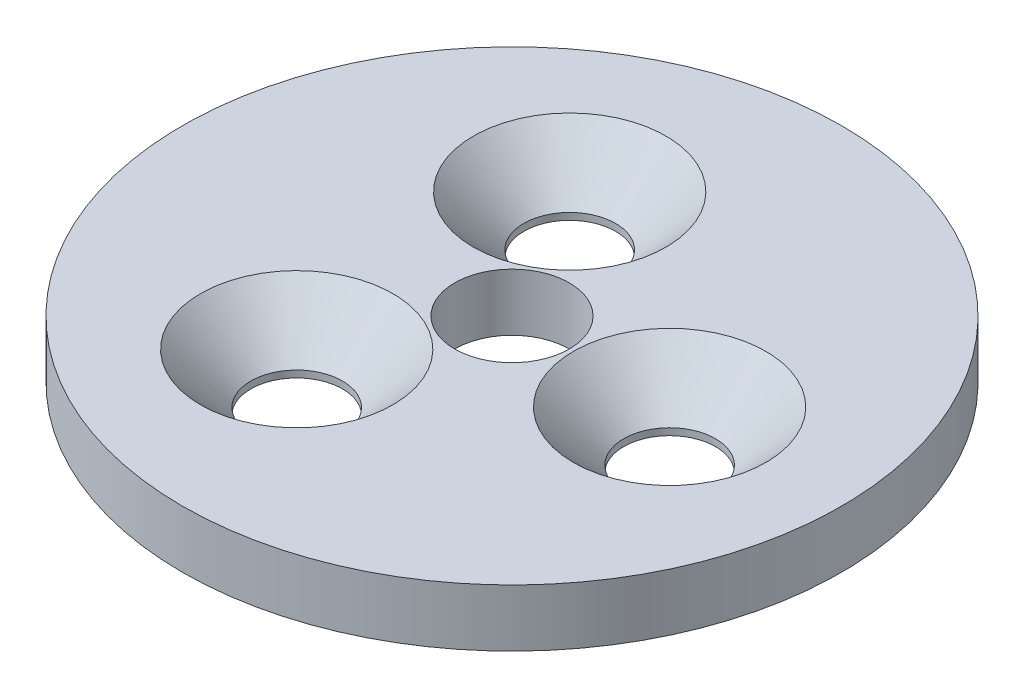
ISO-10303-21;
HEADER;
FILE_DESCRIPTION(('STEP AP214'),'2;1');
FILE_NAME('part.step','',(''),(''),'','','');
FILE_SCHEMA(('AUTOMOTIVE_DESIGN { 1 0 10303 214 1 1 1 1 }'));
ENDSEC;
DATA;
#1=APPLICATION_CONTEXT('core data for automotive mechanical design processes');
#2=APPLICATION_PROTOCOL_DEFINITION('international standard','automotive_design',2000,#1);
#3=PRODUCT_CONTEXT('',#1,'mechanical');
#4=PRODUCT('Part','Part','',(#3));
#5=PRODUCT_RELATED_PRODUCT_CATEGORY('part','',(#4));
#6=PRODUCT_DEFINITION_FORMATION('','',#4);
#7=PRODUCT_DEFINITION_CONTEXT('part definition',#1,'design');
#8=PRODUCT_DEFINITION('design','',#6,#7);
#9=PRODUCT_DEFINITION_SHAPE('','',#8);
#10=(LENGTH_UNIT() NAMED_UNIT(*) SI_UNIT(.MILLI.,.METRE.));
#11=(NAMED_UNIT(*) PLANE_ANGLE_UNIT() SI_UNIT($,.RADIAN.));
#12=(NAMED_UNIT(*) SI_UNIT($,.STERADIAN.) SOLID_ANGLE_UNIT());
#13=UNCERTAINTY_MEASURE_WITH_UNIT(LENGTH_MEASURE(1.E-05),#10,'distance_accuracy_value','');
#14=(GEOMETRIC_REPRESENTATION_CONTEXT(3) GLOBAL_UNCERTAINTY_ASSIGNED_CONTEXT((#13)) GLOBAL_UNIT_ASSIGNED_CONTEXT((#10,
#11,#12)) REPRESENTATION_CONTEXT('',''));
#15=CARTESIAN_POINT('',(0.,0.,0.));
#16=DIRECTION('',(0.,0.,1.));
#17=DIRECTION('',(1.,0.,0.));
#18=AXIS2_PLACEMENT_3D('',#15,#16,#17);
#19=CARTESIAN_POINT('',(0.,2.,0.));
#20=DIRECTION('',(0.,-1.,0.));
#21=DIRECTION('',(0.,0.,-1.));
#22=AXIS2_PLACEMENT_3D('',#19,#20,#21);
#23=CYLINDRICAL_SURFACE('',#22,11.5);
#24=CARTESIAN_POINT('',(0.,2.,0.));
#25=DIRECTION('',(0.,1.,0.));
#26=DIRECTION('',(0.,0.,1.));
#27=AXIS2_PLACEMENT_3D('',#24,#25,#26);
#28=CIRCLE('',#27,11.5);
#29=CARTESIAN_POINT('',(0.,2.,11.5));
#30=VERTEX_POINT('',#29);
#31=EDGE_CURVE('E10',#30,#30,#28,.T.);
#32=ORIENTED_EDGE('',*,*,#31,.F.);
#33=EDGE_LOOP('',(#32));
#34=FACE_BOUND('',#33,.T.);
#35=CARTESIAN_POINT('',(0.,0.,0.));
#36=DIRECTION('',(0.,1.,0.));
#37=DIRECTION('',(0.,0.,1.));
#38=AXIS2_PLACEMENT_3D('',#35,#36,#37);
#39=CIRCLE('',#38,11.5);
#40=CARTESIAN_POINT('',(0.,0.,11.5));
#41=VERTEX_POINT('',#40);
#42=EDGE_CURVE('E35',#41,#41,#39,.T.);
#43=ORIENTED_EDGE('',*,*,#42,.T.);
#44=EDGE_LOOP('',(#43));
#45=FACE_BOUND('',#44,.T.);
#46=ADVANCED_FACE('F32',(#34,#45),#23,.T.);
#47=CARTESIAN_POINT('',(0.,2.,0.));
#48=DIRECTION('',(0.,1.,0.));
#49=DIRECTION('',(0.,0.,1.));
#50=AXIS2_PLACEMENT_3D('',#47,#48,#49);
#51=PLANE('',#50);
#52=CARTESIAN_POINT('',(0.,2.,0.));
#53=DIRECTION('',(0.,1.,0.));
#54=DIRECTION('',(0.,0.,1.));
#55=AXIS2_PLACEMENT_3D('',#52,#53,#54);
#56=CIRCLE('',#55,2.);
#57=CARTESIAN_POINT('',(0.,2.,2.));
#58=VERTEX_POINT('',#57);
#59=EDGE_CURVE('E73',#58,#58,#56,.T.);
#60=ORIENTED_EDGE('',*,*,#59,.F.);
#61=EDGE_LOOP('',(#60));
#62=FACE_BOUND('',#61,.T.);
#63=CARTESIAN_POINT('',(-2.74999999999996,2.,4.76313972081444));
#64=DIRECTION('',(0.,1.,0.));
#65=DIRECTION('',(0.,0.,1.));
#66=AXIS2_PLACEMENT_3D('',#63,#64,#65);
#67=CIRCLE('',#66,3.36);
#68=CARTESIAN_POINT('',(-2.74999999999996,2.,8.12313972081444));
#69=VERTEX_POINT('',#68);
#70=EDGE_CURVE('E67',#69,#69,#67,.T.);
#71=ORIENTED_EDGE('',*,*,#70,.F.);
#72=EDGE_LOOP('',(#71));
#73=FACE_BOUND('',#72,.T.);
#74=CARTESIAN_POINT('',(-2.75000000000002,2.,-4.7631397208144));
#75=DIRECTION('',(0.,1.,0.));
#76=DIRECTION('',(0.,0.,1.));
#77=AXIS2_PLACEMENT_3D('',#74,#75,#76);
#78=CIRCLE('',#77,3.36);
#79=CARTESIAN_POINT('',(-2.75000000000002,2.,-1.4031397208144));
#80=VERTEX_POINT('',#79);
#81=EDGE_CURVE('E58',#80,#80,#78,.T.);
#82=ORIENTED_EDGE('',*,*,#81,.F.);
#83=EDGE_LOOP('',(#82));
#84=FACE_BOUND('',#83,.T.);
#85=CARTESIAN_POINT('',(5.5,2.,0.));
#86=DIRECTION('',(0.,1.,0.));
#87=DIRECTION('',(0.,0.,1.));
#88=AXIS2_PLACEMENT_3D('',#85,#86,#87);
#89=CIRCLE('',#88,3.36);
#90=CARTESIAN_POINT('',(5.5,2.,3.36));
#91=VERTEX_POINT('',#90);
#92=EDGE_CURVE('E49',#91,#91,#89,.T.);
#93=ORIENTED_EDGE('',*,*,#92,.F.);
#94=EDGE_LOOP('',(#93));
#95=FACE_BOUND('',#94,.T.);
#96=ORIENTED_EDGE('',*,*,#31,.T.);
#97=EDGE_LOOP('',(#96));
#98=FACE_BOUND('',#97,.T.);
#99=ADVANCED_FACE('F79',(#62,#73,#84,#95,#98),#51,.T.);
#100=CARTESIAN_POINT('',(0.,0.,0.));
#101=DIRECTION('',(0.,1.,0.));
#102=DIRECTION('',(0.,0.,1.));
#103=AXIS2_PLACEMENT_3D('',#100,#101,#102);
#104=PLANE('',#103);
#105=CARTESIAN_POINT('',(0.,0.,0.));
#106=DIRECTION('',(0.,1.,0.));
#107=DIRECTION('',(0.,0.,1.));
#108=AXIS2_PLACEMENT_3D('',#105,#106,#107);
#109=CIRCLE('',#108,2.);
#110=CARTESIAN_POINT('',(0.,0.,2.));
#111=VERTEX_POINT('',#110);
#112=EDGE_CURVE('E70',#111,#111,#109,.T.);
#113=ORIENTED_EDGE('',*,*,#112,.T.);
#114=EDGE_LOOP('',(#113));
#115=FACE_BOUND('',#114,.T.);
#116=CARTESIAN_POINT('',(-2.74999999999996,0.,4.76313972081444));
#117=DIRECTION('',(0.,1.,0.));
#118=DIRECTION('',(0.,0.,1.));
#119=AXIS2_PLACEMENT_3D('',#116,#117,#118);
#120=CIRCLE('',#119,1.6);
#121=CARTESIAN_POINT('',(-2.74999999999996,0.,6.36313972081444));
#122=VERTEX_POINT('',#121);
#123=EDGE_CURVE('E61',#122,#122,#120,.T.);
#124=ORIENTED_EDGE('',*,*,#123,.T.);
#125=EDGE_LOOP('',(#124));
#126=FACE_BOUND('',#125,.T.);
#127=CARTESIAN_POINT('',(-2.75000000000002,0.,-4.7631397208144));
#128=DIRECTION('',(0.,1.,0.));
#129=DIRECTION('',(0.,0.,1.));
#130=AXIS2_PLACEMENT_3D('',#127,#128,#129);
#131=CIRCLE('',#130,1.6);
#132=CARTESIAN_POINT('',(-2.75000000000002,0.,-3.1631397208144));
#133=VERTEX_POINT('',#132);
#134=EDGE_CURVE('E52',#133,#133,#131,.T.);
#135=ORIENTED_EDGE('',*,*,#134,.T.);
#136=EDGE_LOOP('',(#135));
#137=FACE_BOUND('',#136,.T.);
#138=CARTESIAN_POINT('',(5.5,0.,0.));
#139=DIRECTION('',(0.,1.,0.));
#140=DIRECTION('',(0.,0.,1.));
#141=AXIS2_PLACEMENT_3D('',#138,#139,#140);
#142=CIRCLE('',#141,1.6);
#143=CARTESIAN_POINT('',(5.5,0.,1.6));
#144=VERTEX_POINT('',#143);
#145=EDGE_CURVE('E42',#144,#144,#142,.T.);
#146=ORIENTED_EDGE('',*,*,#145,.T.);
#147=EDGE_LOOP('',(#146));
#148=FACE_BOUND('',#147,.T.);
#149=ORIENTED_EDGE('',*,*,#42,.F.);
#150=EDGE_LOOP('',(#149));
#151=FACE_BOUND('',#150,.T.);
#152=ADVANCED_FACE('F82',(#115,#126,#137,#148,#151),#104,.F.);
#153=CARTESIAN_POINT('',(5.5,2.,0.));
#154=DIRECTION('',(0.,1.,0.));
#155=DIRECTION('',(0.,0.,1.));
#156=AXIS2_PLACEMENT_3D('',#153,#154,#155);
#157=CYLINDRICAL_SURFACE('',#156,1.6);
#158=ORIENTED_EDGE('',*,*,#145,.F.);
#159=EDGE_LOOP('',(#158));
#160=FACE_BOUND('',#159,.T.);
#161=CARTESIAN_POINT('',(5.5,0.240000000000001,0.));
#162=DIRECTION('',(0.,1.,0.));
#163=DIRECTION('',(0.,0.,1.));
#164=AXIS2_PLACEMENT_3D('',#161,#162,#163);
#165=CIRCLE('',#164,1.6);
#166=CARTESIAN_POINT('',(5.5,0.240000000000001,1.6));
#167=VERTEX_POINT('',#166);
#168=EDGE_CURVE('E46',#167,#167,#165,.T.);
#169=ORIENTED_EDGE('',*,*,#168,.T.);
#170=EDGE_LOOP('',(#169));
#171=FACE_BOUND('',#170,.T.);
#172=ADVANCED_FACE('F93',(#160,#171),#157,.F.);
#173=CARTESIAN_POINT('',(5.5,2.,0.));
#174=DIRECTION('',(0.,1.,0.));
#175=DIRECTION('',(0.,0.,1.));
#176=AXIS2_PLACEMENT_3D('',#173,#174,#175);
#177=CONICAL_SURFACE('',#176,3.36,0.785398163397448);
#178=ORIENTED_EDGE('',*,*,#168,.F.);
#179=EDGE_LOOP('',(#178));
#180=FACE_BOUND('',#179,.T.);
#181=ORIENTED_EDGE('',*,*,#92,.T.);
#182=EDGE_LOOP('',(#181));
#183=FACE_BOUND('',#182,.T.);
#184=ADVANCED_FACE('F90',(#180,#183),#177,.F.);
#185=CARTESIAN_POINT('',(-2.75000000000002,2.,-4.7631397208144));
#186=DIRECTION('',(0.,1.,0.));
#187=DIRECTION('',(0.,0.,1.));
#188=AXIS2_PLACEMENT_3D('',#185,#186,#187);
#189=CYLINDRICAL_SURFACE('',#188,1.6);
#190=ORIENTED_EDGE('',*,*,#134,.F.);
#191=EDGE_LOOP('',(#190));
#192=FACE_BOUND('',#191,.T.);
#193=CARTESIAN_POINT('',(-2.75000000000002,0.240000000000001,-4.7631397208144));
#194=DIRECTION('',(0.,1.,0.));
#195=DIRECTION('',(0.,0.,1.));
#196=AXIS2_PLACEMENT_3D('',#193,#194,#195);
#197=CIRCLE('',#196,1.6);
#198=CARTESIAN_POINT('',(-2.75000000000002,0.240000000000001,-3.1631397208144));
#199=VERTEX_POINT('',#198);
#200=EDGE_CURVE('E55',#199,#199,#197,.T.);
#201=ORIENTED_EDGE('',*,*,#200,.T.);
#202=EDGE_LOOP('',(#201));
#203=FACE_BOUND('',#202,.T.);
#204=ADVANCED_FACE('F92',(#192,#203),#189,.F.);
#205=CARTESIAN_POINT('',(-2.75000000000002,2.,-4.7631397208144));
#206=DIRECTION('',(0.,1.,0.));
#207=DIRECTION('',(0.,0.,1.));
#208=AXIS2_PLACEMENT_3D('',#205,#206,#207);
#209=CONICAL_SURFACE('',#208,3.36,0.785398163397448);
#210=ORIENTED_EDGE('',*,*,#200,.F.);
#211=EDGE_LOOP('',(#210));
#212=FACE_BOUND('',#211,.T.);
#213=ORIENTED_EDGE('',*,*,#81,.T.);
#214=EDGE_LOOP('',(#213));
#215=FACE_BOUND('',#214,.T.);
#216=ADVANCED_FACE('F100',(#212,#215),#209,.F.);
#217=CARTESIAN_POINT('',(-2.74999999999996,2.,4.76313972081444));
#218=DIRECTION('',(0.,1.,0.));
#219=DIRECTION('',(0.,0.,1.));
#220=AXIS2_PLACEMENT_3D('',#217,#218,#219);
#221=CYLINDRICAL_SURFACE('',#220,1.6);
#222=ORIENTED_EDGE('',*,*,#123,.F.);
#223=EDGE_LOOP('',(#222));
#224=FACE_BOUND('',#223,.T.);
#225=CARTESIAN_POINT('',(-2.74999999999996,0.240000000000001,4.76313972081444));
#226=DIRECTION('',(0.,1.,0.));
#227=DIRECTION('',(0.,0.,1.));
#228=AXIS2_PLACEMENT_3D('',#225,#226,#227);
#229=CIRCLE('',#228,1.6);
#230=CARTESIAN_POINT('',(-2.74999999999996,0.240000000000001,6.36313972081444));
#231=VERTEX_POINT('',#230);
#232=EDGE_CURVE('E64',#231,#231,#229,.T.);
#233=ORIENTED_EDGE('',*,*,#232,.T.);
#234=EDGE_LOOP('',(#233));
#235=FACE_BOUND('',#234,.T.);
#236=ADVANCED_FACE('F130',(#224,#235),#221,.F.);
#237=CARTESIAN_POINT('',(-2.74999999999996,2.,4.76313972081444));
#238=DIRECTION('',(0.,1.,0.));
#239=DIRECTION('',(0.,0.,1.));
#240=AXIS2_PLACEMENT_3D('',#237,#238,#239);
#241=CONICAL_SURFACE('',#240,3.36,0.785398163397448);
#242=ORIENTED_EDGE('',*,*,#232,.F.);
#243=EDGE_LOOP('',(#242));
#244=FACE_BOUND('',#243,.T.);
#245=ORIENTED_EDGE('',*,*,#70,.T.);
#246=EDGE_LOOP('',(#245));
#247=FACE_BOUND('',#246,.T.);
#248=ADVANCED_FACE('F135',(#244,#247),#241,.F.);
#249=CARTESIAN_POINT('',(0.,2.,0.));
#250=DIRECTION('',(0.,1.,0.));
#251=DIRECTION('',(0.,0.,1.));
#252=AXIS2_PLACEMENT_3D('',#249,#250,#251);
#253=CYLINDRICAL_SURFACE('',#252,2.);
#254=ORIENTED_EDGE('',*,*,#112,.F.);
#255=EDGE_LOOP('',(#254));
#256=FACE_BOUND('',#255,.T.);
#257=ORIENTED_EDGE('',*,*,#59,.T.);
#258=EDGE_LOOP('',(#257));
#259=FACE_BOUND('',#258,.T.);
#260=ADVANCED_FACE('F77',(#256,#259),#253,.F.);
#261=CLOSED_SHELL('',(#46,#99,#152,#172,#184,#204,#216,#236,#248,#260));
#262=MANIFOLD_SOLID_BREP('B2',#261);
#263=ADVANCED_BREP_SHAPE_REPRESENTATION('',(#18,#262),#14);
#264=SHAPE_DEFINITION_REPRESENTATION(#9,#263);
ENDSEC;
END-ISO-10303-21;
